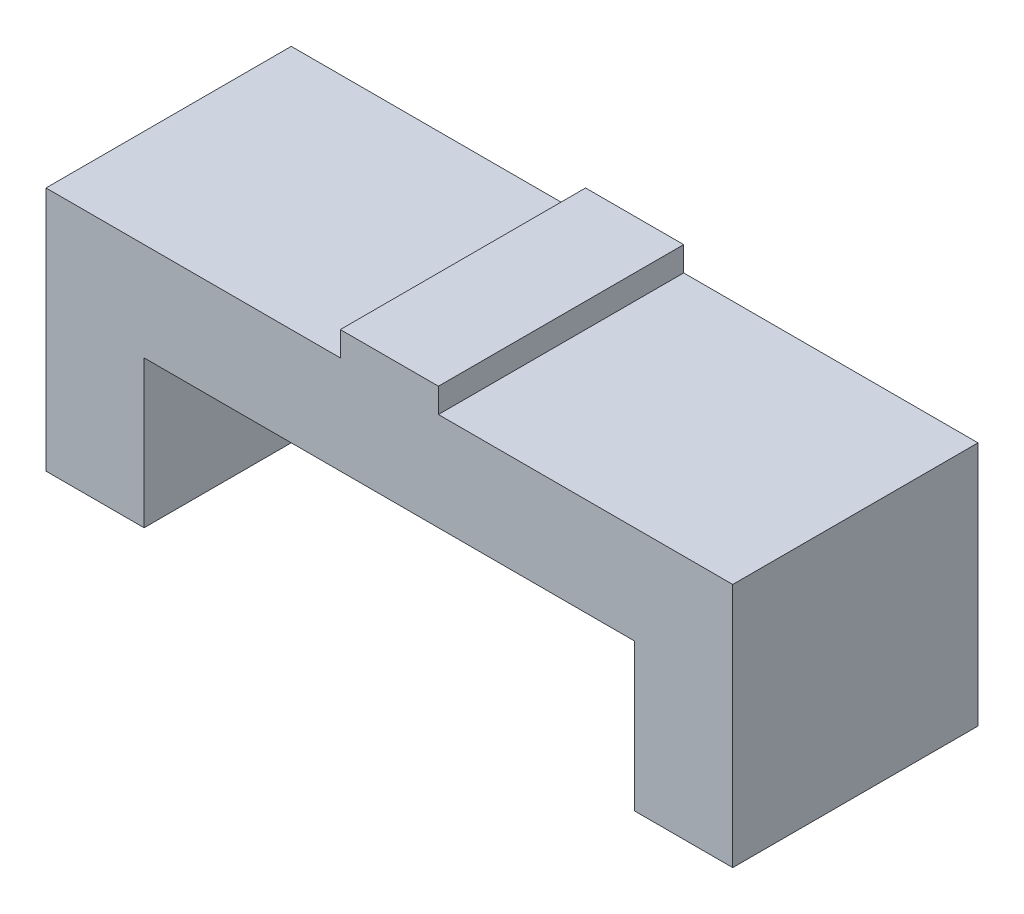
ISO-10303-21;
HEADER;
FILE_DESCRIPTION(('STEP AP214'),'2;1');
FILE_NAME('part.step','',(''),(''),'','','');
FILE_SCHEMA(('AUTOMOTIVE_DESIGN { 1 0 10303 214 1 1 1 1 }'));
ENDSEC;
DATA;
#1=APPLICATION_CONTEXT('core data for automotive mechanical design processes');
#2=APPLICATION_PROTOCOL_DEFINITION('international standard','automotive_design',2000,#1);
#3=PRODUCT_CONTEXT('',#1,'mechanical');
#4=PRODUCT('Part','Part','',(#3));
#5=PRODUCT_RELATED_PRODUCT_CATEGORY('part','',(#4));
#6=PRODUCT_DEFINITION_FORMATION('','',#4);
#7=PRODUCT_DEFINITION_CONTEXT('part definition',#1,'design');
#8=PRODUCT_DEFINITION('design','',#6,#7);
#9=PRODUCT_DEFINITION_SHAPE('','',#8);
#10=(LENGTH_UNIT() NAMED_UNIT(*) SI_UNIT(.MILLI.,.METRE.));
#11=(NAMED_UNIT(*) PLANE_ANGLE_UNIT() SI_UNIT($,.RADIAN.));
#12=(NAMED_UNIT(*) SI_UNIT($,.STERADIAN.) SOLID_ANGLE_UNIT());
#13=UNCERTAINTY_MEASURE_WITH_UNIT(LENGTH_MEASURE(1.E-05),#10,'distance_accuracy_value','');
#14=(GEOMETRIC_REPRESENTATION_CONTEXT(3) GLOBAL_UNCERTAINTY_ASSIGNED_CONTEXT((#13)) GLOBAL_UNIT_ASSIGNED_CONTEXT((#10,
#11,#12)) REPRESENTATION_CONTEXT('',''));
#15=CARTESIAN_POINT('',(0.,0.,0.));
#16=DIRECTION('',(0.,0.,1.));
#17=DIRECTION('',(1.,0.,0.));
#18=AXIS2_PLACEMENT_3D('',#15,#16,#17);
#19=CARTESIAN_POINT('',(0.,50.,50.));
#20=DIRECTION('',(0.,-1.,0.));
#21=DIRECTION('',(1.,0.,0.));
#22=AXIS2_PLACEMENT_3D('',#19,#20,#21);
#23=PLANE('',#22);
#24=DIRECTION('',(0.,0.,-1.));
#25=VECTOR('',#24,1.);
#26=CARTESIAN_POINT('',(10.,50.,50.));
#27=LINE('',#26,#25);
#28=CARTESIAN_POINT('',(10.,50.,50.));
#29=VERTEX_POINT('',#28);
#30=CARTESIAN_POINT('',(10.,50.,0.));
#31=VERTEX_POINT('',#30);
#32=EDGE_CURVE('E55',#29,#31,#27,.T.);
#33=ORIENTED_EDGE('',*,*,#32,.F.);
#34=DIRECTION('',(-1.,0.,0.));
#35=VECTOR('',#34,1.);
#36=CARTESIAN_POINT('',(0.,50.,50.));
#37=LINE('',#36,#35);
#38=CARTESIAN_POINT('',(70.,50.,50.));
#39=VERTEX_POINT('',#38);
#40=EDGE_CURVE('E188',#39,#29,#37,.T.);
#41=ORIENTED_EDGE('',*,*,#40,.F.);
#42=DIRECTION('',(0.,0.,-1.));
#43=VECTOR('',#42,1.);
#44=CARTESIAN_POINT('',(70.,50.,50.));
#45=LINE('',#44,#43);
#46=CARTESIAN_POINT('',(70.,50.,0.));
#47=VERTEX_POINT('',#46);
#48=EDGE_CURVE('E196',#39,#47,#45,.T.);
#49=ORIENTED_EDGE('',*,*,#48,.T.);
#50=DIRECTION('',(-1.,0.,0.));
#51=VECTOR('',#50,1.);
#52=CARTESIAN_POINT('',(0.,50.,0.));
#53=LINE('',#52,#51);
#54=EDGE_CURVE('E222',#47,#31,#53,.T.);
#55=ORIENTED_EDGE('',*,*,#54,.T.);
#56=EDGE_LOOP('',(#33,#41,#49,#55));
#57=FACE_BOUND('',#56,.T.);
#58=ADVANCED_FACE('F38',(#57),#23,.F.);
#59=DIRECTION('',(0.,0.,1.));
#60=VECTOR('',#59,1.);
#61=CARTESIAN_POINT('',(-10.,50.,50.));
#62=LINE('',#61,#60);
#63=CARTESIAN_POINT('',(-10.,50.,0.));
#64=VERTEX_POINT('',#63);
#65=CARTESIAN_POINT('',(-10.,50.,50.));
#66=VERTEX_POINT('',#65);
#67=EDGE_CURVE('E63',#64,#66,#62,.T.);
#68=ORIENTED_EDGE('',*,*,#67,.F.);
#69=CARTESIAN_POINT('',(-70.,50.,0.));
#70=VERTEX_POINT('',#69);
#71=EDGE_CURVE('E199',#64,#70,#53,.T.);
#72=ORIENTED_EDGE('',*,*,#71,.T.);
#73=DIRECTION('',(0.,0.,-1.));
#74=VECTOR('',#73,1.);
#75=CARTESIAN_POINT('',(-70.,50.,50.));
#76=LINE('',#75,#74);
#77=CARTESIAN_POINT('',(-70.,50.,50.));
#78=VERTEX_POINT('',#77);
#79=EDGE_CURVE('E194',#78,#70,#76,.T.);
#80=ORIENTED_EDGE('',*,*,#79,.F.);
#81=EDGE_CURVE('E176',#66,#78,#37,.T.);
#82=ORIENTED_EDGE('',*,*,#81,.F.);
#83=EDGE_LOOP('',(#68,#72,#80,#82));
#84=FACE_BOUND('',#83,.T.);
#85=ADVANCED_FACE('F268',(#84),#23,.F.);
#86=CARTESIAN_POINT('',(-70.,0.,50.));
#87=DIRECTION('',(-1.,0.,0.));
#88=DIRECTION('',(0.,0.,1.));
#89=AXIS2_PLACEMENT_3D('',#86,#87,#88);
#90=PLANE('',#89);
#91=DIRECTION('',(0.,1.,0.));
#92=VECTOR('',#91,1.);
#93=CARTESIAN_POINT('',(-70.,0.,0.));
#94=LINE('',#93,#92);
#95=CARTESIAN_POINT('',(-70.,0.,0.));
#96=VERTEX_POINT('',#95);
#97=EDGE_CURVE('E152',#96,#70,#94,.T.);
#98=ORIENTED_EDGE('',*,*,#97,.F.);
#99=DIRECTION('',(0.,0.,-1.));
#100=VECTOR('',#99,1.);
#101=CARTESIAN_POINT('',(-70.,0.,50.));
#102=LINE('',#101,#100);
#103=CARTESIAN_POINT('',(-70.,0.,50.));
#104=VERTEX_POINT('',#103);
#105=EDGE_CURVE('E11',#104,#96,#102,.T.);
#106=ORIENTED_EDGE('',*,*,#105,.F.);
#107=DIRECTION('',(0.,1.,0.));
#108=VECTOR('',#107,1.);
#109=CARTESIAN_POINT('',(-70.,0.,50.));
#110=LINE('',#109,#108);
#111=EDGE_CURVE('E171',#104,#78,#110,.T.);
#112=ORIENTED_EDGE('',*,*,#111,.T.);
#113=ORIENTED_EDGE('',*,*,#79,.T.);
#114=EDGE_LOOP('',(#98,#106,#112,#113));
#115=FACE_BOUND('',#114,.T.);
#116=ADVANCED_FACE('F40',(#115),#90,.T.);
#117=CARTESIAN_POINT('',(0.,0.,50.));
#118=DIRECTION('',(0.,-1.,0.));
#119=DIRECTION('',(1.,0.,0.));
#120=AXIS2_PLACEMENT_3D('',#117,#118,#119);
#121=PLANE('',#120);
#122=DIRECTION('',(-1.,0.,0.));
#123=VECTOR('',#122,1.);
#124=CARTESIAN_POINT('',(0.,0.,0.));
#125=LINE('',#124,#123);
#126=CARTESIAN_POINT('',(-50.,0.,0.));
#127=VERTEX_POINT('',#126);
#128=EDGE_CURVE('E154',#127,#96,#125,.T.);
#129=ORIENTED_EDGE('',*,*,#128,.F.);
#130=DIRECTION('',(0.,0.,-1.));
#131=VECTOR('',#130,1.);
#132=CARTESIAN_POINT('',(-50.,0.,50.));
#133=LINE('',#132,#131);
#134=CARTESIAN_POINT('',(-50.,0.,50.));
#135=VERTEX_POINT('',#134);
#136=EDGE_CURVE('E47',#135,#127,#133,.T.);
#137=ORIENTED_EDGE('',*,*,#136,.F.);
#138=DIRECTION('',(-1.,0.,0.));
#139=VECTOR('',#138,1.);
#140=CARTESIAN_POINT('',(0.,0.,50.));
#141=LINE('',#140,#139);
#142=EDGE_CURVE('E263',#135,#104,#141,.T.);
#143=ORIENTED_EDGE('',*,*,#142,.T.);
#144=ORIENTED_EDGE('',*,*,#105,.T.);
#145=EDGE_LOOP('',(#129,#137,#143,#144));
#146=FACE_BOUND('',#145,.T.);
#147=ADVANCED_FACE('F262',(#146),#121,.T.);
#148=CARTESIAN_POINT('',(-50.,0.,50.));
#149=DIRECTION('',(-1.,0.,0.));
#150=DIRECTION('',(0.,-1.,0.));
#151=AXIS2_PLACEMENT_3D('',#148,#149,#150);
#152=PLANE('',#151);
#153=DIRECTION('',(0.,1.,0.));
#154=VECTOR('',#153,1.);
#155=CARTESIAN_POINT('',(-50.,0.,0.));
#156=LINE('',#155,#154);
#157=CARTESIAN_POINT('',(-50.,30.,0.));
#158=VERTEX_POINT('',#157);
#159=EDGE_CURVE('E209',#127,#158,#156,.T.);
#160=ORIENTED_EDGE('',*,*,#159,.T.);
#161=DIRECTION('',(0.,0.,-1.));
#162=VECTOR('',#161,1.);
#163=CARTESIAN_POINT('',(-50.,30.,50.));
#164=LINE('',#163,#162);
#165=CARTESIAN_POINT('',(-50.,30.,50.));
#166=VERTEX_POINT('',#165);
#167=EDGE_CURVE('E225',#166,#158,#164,.T.);
#168=ORIENTED_EDGE('',*,*,#167,.F.);
#169=DIRECTION('',(0.,1.,0.));
#170=VECTOR('',#169,1.);
#171=CARTESIAN_POINT('',(-50.,0.,50.));
#172=LINE('',#171,#170);
#173=EDGE_CURVE('E258',#135,#166,#172,.T.);
#174=ORIENTED_EDGE('',*,*,#173,.F.);
#175=ORIENTED_EDGE('',*,*,#136,.T.);
#176=EDGE_LOOP('',(#160,#168,#174,#175));
#177=FACE_BOUND('',#176,.T.);
#178=ADVANCED_FACE('F257',(#177),#152,.F.);
#179=CARTESIAN_POINT('',(0.,30.,50.));
#180=DIRECTION('',(0.,1.,0.));
#181=DIRECTION('',(-1.,0.,0.));
#182=AXIS2_PLACEMENT_3D('',#179,#180,#181);
#183=PLANE('',#182);
#184=DIRECTION('',(1.,0.,0.));
#185=VECTOR('',#184,1.);
#186=CARTESIAN_POINT('',(0.,30.,0.));
#187=LINE('',#186,#185);
#188=CARTESIAN_POINT('',(50.,30.,0.));
#189=VERTEX_POINT('',#188);
#190=EDGE_CURVE('E212',#158,#189,#187,.T.);
#191=ORIENTED_EDGE('',*,*,#190,.T.);
#192=DIRECTION('',(0.,0.,-1.));
#193=VECTOR('',#192,1.);
#194=CARTESIAN_POINT('',(50.,30.,50.));
#195=LINE('',#194,#193);
#196=CARTESIAN_POINT('',(50.,30.,50.));
#197=VERTEX_POINT('',#196);
#198=EDGE_CURVE('E228',#197,#189,#195,.T.);
#199=ORIENTED_EDGE('',*,*,#198,.F.);
#200=DIRECTION('',(1.,0.,0.));
#201=VECTOR('',#200,1.);
#202=CARTESIAN_POINT('',(0.,30.,50.));
#203=LINE('',#202,#201);
#204=EDGE_CURVE('E254',#166,#197,#203,.T.);
#205=ORIENTED_EDGE('',*,*,#204,.F.);
#206=ORIENTED_EDGE('',*,*,#167,.T.);
#207=EDGE_LOOP('',(#191,#199,#205,#206));
#208=FACE_BOUND('',#207,.T.);
#209=ADVANCED_FACE('F251',(#208),#183,.F.);
#210=CARTESIAN_POINT('',(50.,0.,50.));
#211=DIRECTION('',(-1.,0.,0.));
#212=DIRECTION('',(0.,0.,1.));
#213=AXIS2_PLACEMENT_3D('',#210,#211,#212);
#214=PLANE('',#213);
#215=DIRECTION('',(0.,1.,0.));
#216=VECTOR('',#215,1.);
#217=CARTESIAN_POINT('',(50.,0.,0.));
#218=LINE('',#217,#216);
#219=CARTESIAN_POINT('',(50.,0.,0.));
#220=VERTEX_POINT('',#219);
#221=EDGE_CURVE('E215',#220,#189,#218,.T.);
#222=ORIENTED_EDGE('',*,*,#221,.F.);
#223=DIRECTION('',(0.,0.,-1.));
#224=VECTOR('',#223,1.);
#225=CARTESIAN_POINT('',(50.,0.,50.));
#226=LINE('',#225,#224);
#227=CARTESIAN_POINT('',(50.,0.,50.));
#228=VERTEX_POINT('',#227);
#229=EDGE_CURVE('E230',#228,#220,#226,.T.);
#230=ORIENTED_EDGE('',*,*,#229,.F.);
#231=DIRECTION('',(0.,1.,0.));
#232=VECTOR('',#231,1.);
#233=CARTESIAN_POINT('',(50.,0.,50.));
#234=LINE('',#233,#232);
#235=EDGE_CURVE('E270',#228,#197,#234,.T.);
#236=ORIENTED_EDGE('',*,*,#235,.T.);
#237=ORIENTED_EDGE('',*,*,#198,.T.);
#238=EDGE_LOOP('',(#222,#230,#236,#237));
#239=FACE_BOUND('',#238,.T.);
#240=ADVANCED_FACE('F245',(#239),#214,.T.);
#241=CARTESIAN_POINT('',(70.,0.,0.));
#242=VERTEX_POINT('',#241);
#243=EDGE_CURVE('E210',#242,#220,#125,.T.);
#244=ORIENTED_EDGE('',*,*,#243,.F.);
#245=DIRECTION('',(0.,0.,-1.));
#246=VECTOR('',#245,1.);
#247=CARTESIAN_POINT('',(70.,0.,50.));
#248=LINE('',#247,#246);
#249=CARTESIAN_POINT('',(70.,0.,50.));
#250=VERTEX_POINT('',#249);
#251=EDGE_CURVE('E232',#250,#242,#248,.T.);
#252=ORIENTED_EDGE('',*,*,#251,.F.);
#253=EDGE_CURVE('E241',#250,#228,#141,.T.);
#254=ORIENTED_EDGE('',*,*,#253,.T.);
#255=ORIENTED_EDGE('',*,*,#229,.T.);
#256=EDGE_LOOP('',(#244,#252,#254,#255));
#257=FACE_BOUND('',#256,.T.);
#258=ADVANCED_FACE('F238',(#257),#121,.T.);
#259=CARTESIAN_POINT('',(70.,0.,50.));
#260=DIRECTION('',(-1.,0.,0.));
#261=DIRECTION('',(0.,0.,1.));
#262=AXIS2_PLACEMENT_3D('',#259,#260,#261);
#263=PLANE('',#262);
#264=DIRECTION('',(0.,1.,0.));
#265=VECTOR('',#264,1.);
#266=CARTESIAN_POINT('',(70.,0.,0.));
#267=LINE('',#266,#265);
#268=EDGE_CURVE('E218',#242,#47,#267,.T.);
#269=ORIENTED_EDGE('',*,*,#268,.T.);
#270=ORIENTED_EDGE('',*,*,#48,.F.);
#271=DIRECTION('',(0.,1.,0.));
#272=VECTOR('',#271,1.);
#273=CARTESIAN_POINT('',(70.,0.,50.));
#274=LINE('',#273,#272);
#275=EDGE_CURVE('E191',#250,#39,#274,.T.);
#276=ORIENTED_EDGE('',*,*,#275,.F.);
#277=ORIENTED_EDGE('',*,*,#251,.T.);
#278=EDGE_LOOP('',(#269,#270,#276,#277));
#279=FACE_BOUND('',#278,.T.);
#280=ADVANCED_FACE('F281',(#279),#263,.F.);
#281=CARTESIAN_POINT('',(0.,0.,50.));
#282=DIRECTION('',(0.,0.,1.));
#283=DIRECTION('',(1.,0.,0.));
#284=AXIS2_PLACEMENT_3D('',#281,#282,#283);
#285=PLANE('',#284);
#286=ORIENTED_EDGE('',*,*,#111,.F.);
#287=ORIENTED_EDGE('',*,*,#142,.F.);
#288=ORIENTED_EDGE('',*,*,#173,.T.);
#289=ORIENTED_EDGE('',*,*,#204,.T.);
#290=ORIENTED_EDGE('',*,*,#235,.F.);
#291=ORIENTED_EDGE('',*,*,#253,.F.);
#292=ORIENTED_EDGE('',*,*,#275,.T.);
#293=ORIENTED_EDGE('',*,*,#40,.T.);
#294=DIRECTION('',(0.,-1.,0.));
#295=VECTOR('',#294,1.);
#296=CARTESIAN_POINT('',(10.,55.,50.));
#297=LINE('',#296,#295);
#298=CARTESIAN_POINT('',(10.,55.,50.));
#299=VERTEX_POINT('',#298);
#300=EDGE_CURVE('E164',#299,#29,#297,.T.);
#301=ORIENTED_EDGE('',*,*,#300,.F.);
#302=DIRECTION('',(1.,0.,0.));
#303=VECTOR('',#302,1.);
#304=CARTESIAN_POINT('',(-10.,55.,50.));
#305=LINE('',#304,#303);
#306=CARTESIAN_POINT('',(-10.,55.,50.));
#307=VERTEX_POINT('',#306);
#308=EDGE_CURVE('E146',#307,#299,#305,.T.);
#309=ORIENTED_EDGE('',*,*,#308,.F.);
#310=DIRECTION('',(0.,-1.,0.));
#311=VECTOR('',#310,1.);
#312=CARTESIAN_POINT('',(-10.,55.,50.));
#313=LINE('',#312,#311);
#314=EDGE_CURVE('E156',#307,#66,#313,.T.);
#315=ORIENTED_EDGE('',*,*,#314,.T.);
#316=ORIENTED_EDGE('',*,*,#81,.T.);
#317=EDGE_LOOP('',(#286,#287,#288,#289,#290,#291,#292,#293,#301,#309,#315,#316));
#318=FACE_BOUND('',#317,.T.);
#319=ADVANCED_FACE('F187',(#318),#285,.T.);
#320=CARTESIAN_POINT('',(0.,0.,0.));
#321=DIRECTION('',(0.,0.,1.));
#322=DIRECTION('',(1.,0.,0.));
#323=AXIS2_PLACEMENT_3D('',#320,#321,#322);
#324=PLANE('',#323);
#325=ORIENTED_EDGE('',*,*,#97,.T.);
#326=ORIENTED_EDGE('',*,*,#71,.F.);
#327=DIRECTION('',(0.,-1.,0.));
#328=VECTOR('',#327,1.);
#329=CARTESIAN_POINT('',(-10.,55.,0.));
#330=LINE('',#329,#328);
#331=CARTESIAN_POINT('',(-10.,55.,0.));
#332=VERTEX_POINT('',#331);
#333=EDGE_CURVE('E137',#332,#64,#330,.T.);
#334=ORIENTED_EDGE('',*,*,#333,.F.);
#335=DIRECTION('',(-1.,0.,0.));
#336=VECTOR('',#335,1.);
#337=CARTESIAN_POINT('',(-10.,55.,0.));
#338=LINE('',#337,#336);
#339=CARTESIAN_POINT('',(10.,55.,0.));
#340=VERTEX_POINT('',#339);
#341=EDGE_CURVE('E129',#340,#332,#338,.T.);
#342=ORIENTED_EDGE('',*,*,#341,.F.);
#343=DIRECTION('',(0.,-1.,0.));
#344=VECTOR('',#343,1.);
#345=CARTESIAN_POINT('',(10.,55.,0.));
#346=LINE('',#345,#344);
#347=EDGE_CURVE('E135',#340,#31,#346,.T.);
#348=ORIENTED_EDGE('',*,*,#347,.T.);
#349=ORIENTED_EDGE('',*,*,#54,.F.);
#350=ORIENTED_EDGE('',*,*,#268,.F.);
#351=ORIENTED_EDGE('',*,*,#243,.T.);
#352=ORIENTED_EDGE('',*,*,#221,.T.);
#353=ORIENTED_EDGE('',*,*,#190,.F.);
#354=ORIENTED_EDGE('',*,*,#159,.F.);
#355=ORIENTED_EDGE('',*,*,#128,.T.);
#356=EDGE_LOOP('',(#325,#326,#334,#342,#348,#349,#350,#351,#352,#353,#354,#355));
#357=FACE_BOUND('',#356,.T.);
#358=ADVANCED_FACE('F132',(#357),#324,.F.);
#359=CARTESIAN_POINT('',(10.,55.,50.));
#360=DIRECTION('',(-1.,0.,0.));
#361=DIRECTION('',(0.,-1.,0.));
#362=AXIS2_PLACEMENT_3D('',#359,#360,#361);
#363=PLANE('',#362);
#364=ORIENTED_EDGE('',*,*,#32,.T.);
#365=ORIENTED_EDGE('',*,*,#347,.F.);
#366=DIRECTION('',(0.,0.,-1.));
#367=VECTOR('',#366,1.);
#368=CARTESIAN_POINT('',(10.,55.,50.));
#369=LINE('',#368,#367);
#370=EDGE_CURVE('E141',#299,#340,#369,.T.);
#371=ORIENTED_EDGE('',*,*,#370,.F.);
#372=ORIENTED_EDGE('',*,*,#300,.T.);
#373=EDGE_LOOP('',(#364,#365,#371,#372));
#374=FACE_BOUND('',#373,.T.);
#375=ADVANCED_FACE('F151',(#374),#363,.F.);
#376=CARTESIAN_POINT('',(-10.,55.,50.));
#377=DIRECTION('',(1.,0.,0.));
#378=DIRECTION('',(0.,1.,0.));
#379=AXIS2_PLACEMENT_3D('',#376,#377,#378);
#380=PLANE('',#379);
#381=ORIENTED_EDGE('',*,*,#67,.T.);
#382=ORIENTED_EDGE('',*,*,#314,.F.);
#383=DIRECTION('',(0.,0.,1.));
#384=VECTOR('',#383,1.);
#385=CARTESIAN_POINT('',(-10.,55.,50.));
#386=LINE('',#385,#384);
#387=EDGE_CURVE('E140',#332,#307,#386,.T.);
#388=ORIENTED_EDGE('',*,*,#387,.F.);
#389=ORIENTED_EDGE('',*,*,#333,.T.);
#390=EDGE_LOOP('',(#381,#382,#388,#389));
#391=FACE_BOUND('',#390,.T.);
#392=ADVANCED_FACE('F185',(#391),#380,.F.);
#393=CARTESIAN_POINT('',(0.,55.,0.));
#394=DIRECTION('',(0.,-1.,0.));
#395=DIRECTION('',(0.,0.,-1.));
#396=AXIS2_PLACEMENT_3D('',#393,#394,#395);
#397=PLANE('',#396);
#398=ORIENTED_EDGE('',*,*,#370,.T.);
#399=ORIENTED_EDGE('',*,*,#341,.T.);
#400=ORIENTED_EDGE('',*,*,#387,.T.);
#401=ORIENTED_EDGE('',*,*,#308,.T.);
#402=EDGE_LOOP('',(#398,#399,#400,#401));
#403=FACE_BOUND('',#402,.T.);
#404=ADVANCED_FACE('F144',(#403),#397,.F.);
#405=CLOSED_SHELL('',(#58,#85,#116,#147,#178,#209,#240,#258,#280,#319,#358,#375,#392,#404));
#406=MANIFOLD_SOLID_BREP('B2',#405);
#407=ADVANCED_BREP_SHAPE_REPRESENTATION('',(#18,#406),#14);
#408=SHAPE_DEFINITION_REPRESENTATION(#9,#407);
ENDSEC;
END-ISO-10303-21;
